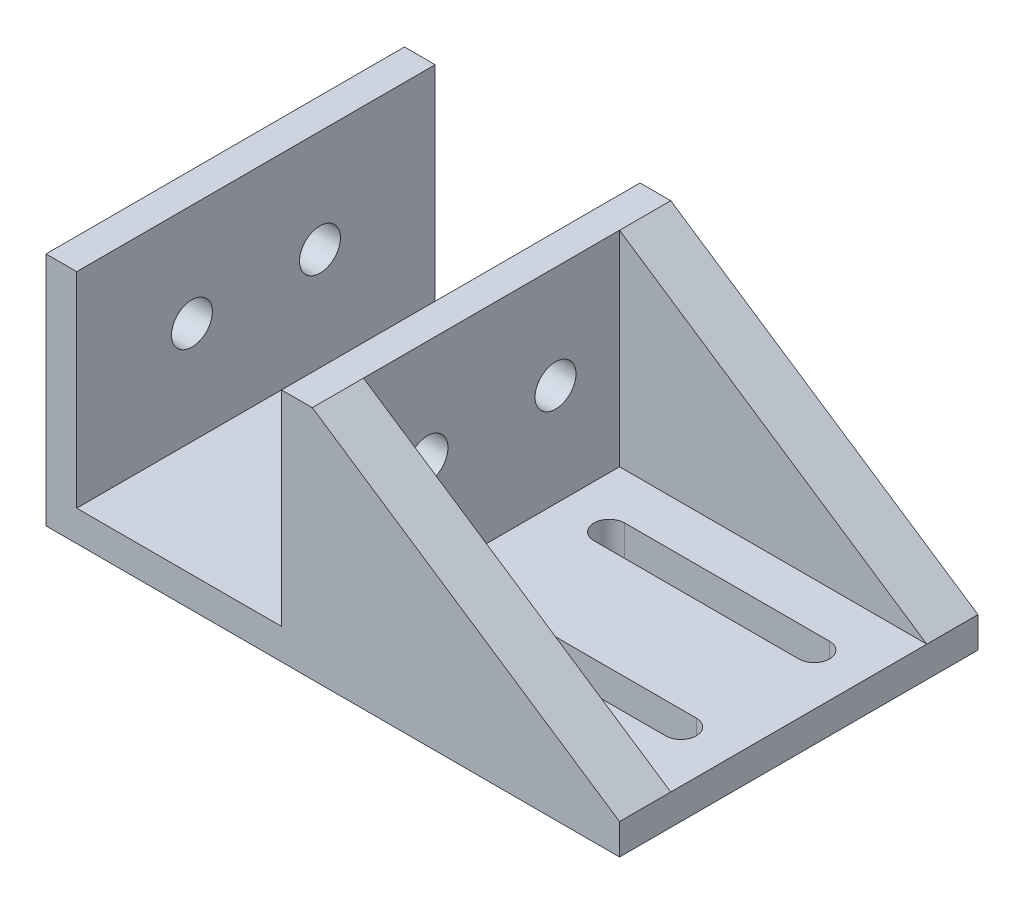
ISO-10303-21;
HEADER;
FILE_DESCRIPTION(('STEP AP214'),'2;1');
FILE_NAME('part.step','',(''),(''),'','','');
FILE_SCHEMA(('AUTOMOTIVE_DESIGN { 1 0 10303 214 1 1 1 1 }'));
ENDSEC;
DATA;
#1=APPLICATION_CONTEXT('core data for automotive mechanical design processes');
#2=APPLICATION_PROTOCOL_DEFINITION('international standard','automotive_design',2000,#1);
#3=PRODUCT_CONTEXT('',#1,'mechanical');
#4=PRODUCT('Part','Part','',(#3));
#5=PRODUCT_RELATED_PRODUCT_CATEGORY('part','',(#4));
#6=PRODUCT_DEFINITION_FORMATION('','',#4);
#7=PRODUCT_DEFINITION_CONTEXT('part definition',#1,'design');
#8=PRODUCT_DEFINITION('design','',#6,#7);
#9=PRODUCT_DEFINITION_SHAPE('','',#8);
#10=(LENGTH_UNIT() NAMED_UNIT(*) SI_UNIT(.MILLI.,.METRE.));
#11=(NAMED_UNIT(*) PLANE_ANGLE_UNIT() SI_UNIT($,.RADIAN.));
#12=(NAMED_UNIT(*) SI_UNIT($,.STERADIAN.) SOLID_ANGLE_UNIT());
#13=UNCERTAINTY_MEASURE_WITH_UNIT(LENGTH_MEASURE(1.E-05),#10,'distance_accuracy_value','');
#14=(GEOMETRIC_REPRESENTATION_CONTEXT(3) GLOBAL_UNCERTAINTY_ASSIGNED_CONTEXT((#13)) GLOBAL_UNIT_ASSIGNED_CONTEXT((#10,
#11,#12)) REPRESENTATION_CONTEXT('',''));
#15=CARTESIAN_POINT('',(0.,0.,0.));
#16=DIRECTION('',(0.,0.,1.));
#17=DIRECTION('',(1.,0.,0.));
#18=AXIS2_PLACEMENT_3D('',#15,#16,#17);
#19=CARTESIAN_POINT('',(56.,3.,0.));
#20=DIRECTION('',(0.554700196225229,0.832050294337844,0.));
#21=DIRECTION('',(-0.832050294337844,0.554700196225229,0.));
#22=AXIS2_PLACEMENT_3D('',#19,#20,#21);
#23=PLANE('',#22);
#24=DIRECTION('',(-0.832050294337844,0.554700196225229,0.));
#25=VECTOR('',#24,1.);
#26=CARTESIAN_POINT('',(56.,3.,5.));
#27=LINE('',#26,#25);
#28=CARTESIAN_POINT('',(56.,3.,5.));
#29=VERTEX_POINT('',#28);
#30=CARTESIAN_POINT('',(26.,23.,5.));
#31=VERTEX_POINT('',#30);
#32=EDGE_CURVE('E11',#29,#31,#27,.T.);
#33=ORIENTED_EDGE('',*,*,#32,.F.);
#34=DIRECTION('',(0.,0.,-1.));
#35=VECTOR('',#34,1.);
#36=CARTESIAN_POINT('',(56.,3.,35.));
#37=LINE('',#36,#35);
#38=CARTESIAN_POINT('',(56.,3.,0.));
#39=VERTEX_POINT('',#38);
#40=EDGE_CURVE('E335',#29,#39,#37,.T.);
#41=ORIENTED_EDGE('',*,*,#40,.T.);
#42=DIRECTION('',(-0.832050294337844,0.554700196225229,0.));
#43=VECTOR('',#42,1.);
#44=CARTESIAN_POINT('',(56.,3.,0.));
#45=LINE('',#44,#43);
#46=CARTESIAN_POINT('',(26.,23.,0.));
#47=VERTEX_POINT('',#46);
#48=EDGE_CURVE('E203',#39,#47,#45,.T.);
#49=ORIENTED_EDGE('',*,*,#48,.T.);
#50=DIRECTION('',(0.,0.,-1.));
#51=VECTOR('',#50,1.);
#52=CARTESIAN_POINT('',(26.,23.,35.));
#53=LINE('',#52,#51);
#54=EDGE_CURVE('E331',#31,#47,#53,.T.);
#55=ORIENTED_EDGE('',*,*,#54,.F.);
#56=EDGE_LOOP('',(#33,#41,#49,#55));
#57=FACE_BOUND('',#56,.T.);
#58=ADVANCED_FACE('F37',(#57),#23,.T.);
#59=CARTESIAN_POINT('',(56.,0.,35.));
#60=DIRECTION('',(-1.,0.,0.));
#61=DIRECTION('',(0.,0.,1.));
#62=AXIS2_PLACEMENT_3D('',#59,#60,#61);
#63=PLANE('',#62);
#64=DIRECTION('',(0.,1.,0.));
#65=VECTOR('',#64,1.);
#66=CARTESIAN_POINT('',(56.,0.,0.));
#67=LINE('',#66,#65);
#68=CARTESIAN_POINT('',(56.,0.,0.));
#69=VERTEX_POINT('',#68);
#70=EDGE_CURVE('E236',#69,#39,#67,.T.);
#71=ORIENTED_EDGE('',*,*,#70,.T.);
#72=ORIENTED_EDGE('',*,*,#40,.F.);
#73=DIRECTION('',(0.,0.,-1.));
#74=VECTOR('',#73,1.);
#75=CARTESIAN_POINT('',(56.,3.,5.));
#76=LINE('',#75,#74);
#77=CARTESIAN_POINT('',(56.,3.,30.));
#78=VERTEX_POINT('',#77);
#79=EDGE_CURVE('E192',#78,#29,#76,.T.);
#80=ORIENTED_EDGE('',*,*,#79,.F.);
#81=CARTESIAN_POINT('',(56.,3.,35.));
#82=VERTEX_POINT('',#81);
#83=EDGE_CURVE('E336',#82,#78,#37,.T.);
#84=ORIENTED_EDGE('',*,*,#83,.F.);
#85=DIRECTION('',(0.,1.,0.));
#86=VECTOR('',#85,1.);
#87=CARTESIAN_POINT('',(56.,0.,35.));
#88=LINE('',#87,#86);
#89=CARTESIAN_POINT('',(56.,0.,35.));
#90=VERTEX_POINT('',#89);
#91=EDGE_CURVE('E278',#90,#82,#88,.T.);
#92=ORIENTED_EDGE('',*,*,#91,.F.);
#93=DIRECTION('',(0.,0.,-1.));
#94=VECTOR('',#93,1.);
#95=CARTESIAN_POINT('',(56.,0.,35.));
#96=LINE('',#95,#94);
#97=EDGE_CURVE('E295',#90,#69,#96,.T.);
#98=ORIENTED_EDGE('',*,*,#97,.T.);
#99=EDGE_LOOP('',(#71,#72,#80,#84,#92,#98));
#100=FACE_BOUND('',#99,.T.);
#101=ADVANCED_FACE('F39',(#100),#63,.F.);
#102=CARTESIAN_POINT('',(26.,23.,35.));
#103=DIRECTION('',(0.,-1.,0.));
#104=DIRECTION('',(0.,0.,-1.));
#105=AXIS2_PLACEMENT_3D('',#102,#103,#104);
#106=PLANE('',#105);
#107=DIRECTION('',(-1.,0.,0.));
#108=VECTOR('',#107,1.);
#109=CARTESIAN_POINT('',(26.,23.,0.));
#110=LINE('',#109,#108);
#111=CARTESIAN_POINT('',(23.,23.,0.));
#112=VERTEX_POINT('',#111);
#113=EDGE_CURVE('E298',#47,#112,#110,.T.);
#114=ORIENTED_EDGE('',*,*,#113,.T.);
#115=DIRECTION('',(0.,0.,-1.));
#116=VECTOR('',#115,1.);
#117=CARTESIAN_POINT('',(23.,23.,35.));
#118=LINE('',#117,#116);
#119=CARTESIAN_POINT('',(23.,23.,35.));
#120=VERTEX_POINT('',#119);
#121=EDGE_CURVE('E328',#120,#112,#118,.T.);
#122=ORIENTED_EDGE('',*,*,#121,.F.);
#123=DIRECTION('',(-1.,0.,0.));
#124=VECTOR('',#123,1.);
#125=CARTESIAN_POINT('',(26.,23.,35.));
#126=LINE('',#125,#124);
#127=CARTESIAN_POINT('',(26.,23.,35.));
#128=VERTEX_POINT('',#127);
#129=EDGE_CURVE('E280',#128,#120,#126,.T.);
#130=ORIENTED_EDGE('',*,*,#129,.F.);
#131=CARTESIAN_POINT('',(26.,23.,30.));
#132=VERTEX_POINT('',#131);
#133=EDGE_CURVE('E332',#128,#132,#53,.T.);
#134=ORIENTED_EDGE('',*,*,#133,.T.);
#135=DIRECTION('',(0.,0.,1.));
#136=VECTOR('',#135,1.);
#137=CARTESIAN_POINT('',(26.,23.,5.));
#138=LINE('',#137,#136);
#139=EDGE_CURVE('E193',#31,#132,#138,.T.);
#140=ORIENTED_EDGE('',*,*,#139,.F.);
#141=ORIENTED_EDGE('',*,*,#54,.T.);
#142=EDGE_LOOP('',(#114,#122,#130,#134,#140,#141));
#143=FACE_BOUND('',#142,.T.);
#144=ADVANCED_FACE('F366',(#143),#106,.F.);
#145=CARTESIAN_POINT('',(23.,23.,35.));
#146=DIRECTION('',(1.,0.,0.));
#147=DIRECTION('',(0.,1.,0.));
#148=AXIS2_PLACEMENT_3D('',#145,#146,#147);
#149=PLANE('',#148);
#150=CARTESIAN_POINT('',(23.,13.,23.75));
#151=DIRECTION('',(1.,0.,0.));
#152=DIRECTION('',(0.,1.,0.));
#153=AXIS2_PLACEMENT_3D('',#150,#151,#152);
#154=CIRCLE('',#153,2.);
#155=CARTESIAN_POINT('',(23.,15.,23.75));
#156=VERTEX_POINT('',#155);
#157=EDGE_CURVE('E195',#156,#156,#154,.T.);
#158=ORIENTED_EDGE('',*,*,#157,.T.);
#159=EDGE_LOOP('',(#158));
#160=FACE_BOUND('',#159,.T.);
#161=CARTESIAN_POINT('',(23.,13.,11.25));
#162=DIRECTION('',(1.,0.,0.));
#163=DIRECTION('',(0.,1.,0.));
#164=AXIS2_PLACEMENT_3D('',#161,#162,#163);
#165=CIRCLE('',#164,2.);
#166=CARTESIAN_POINT('',(23.,15.,11.25));
#167=VERTEX_POINT('',#166);
#168=EDGE_CURVE('E708',#167,#167,#165,.T.);
#169=ORIENTED_EDGE('',*,*,#168,.T.);
#170=EDGE_LOOP('',(#169));
#171=FACE_BOUND('',#170,.T.);
#172=DIRECTION('',(0.,-1.,0.));
#173=VECTOR('',#172,1.);
#174=CARTESIAN_POINT('',(23.,23.,0.));
#175=LINE('',#174,#173);
#176=CARTESIAN_POINT('',(23.,3.,0.));
#177=VERTEX_POINT('',#176);
#178=EDGE_CURVE('E300',#112,#177,#175,.T.);
#179=ORIENTED_EDGE('',*,*,#178,.T.);
#180=DIRECTION('',(0.,0.,-1.));
#181=VECTOR('',#180,1.);
#182=CARTESIAN_POINT('',(23.,3.,35.));
#183=LINE('',#182,#181);
#184=CARTESIAN_POINT('',(23.,3.,35.));
#185=VERTEX_POINT('',#184);
#186=EDGE_CURVE('E325',#185,#177,#183,.T.);
#187=ORIENTED_EDGE('',*,*,#186,.F.);
#188=DIRECTION('',(0.,-1.,0.));
#189=VECTOR('',#188,1.);
#190=CARTESIAN_POINT('',(23.,23.,35.));
#191=LINE('',#190,#189);
#192=EDGE_CURVE('E283',#120,#185,#191,.T.);
#193=ORIENTED_EDGE('',*,*,#192,.F.);
#194=ORIENTED_EDGE('',*,*,#121,.T.);
#195=EDGE_LOOP('',(#179,#187,#193,#194));
#196=FACE_BOUND('',#195,.T.);
#197=ADVANCED_FACE('F370',(#160,#171,#196),#149,.F.);
#198=CARTESIAN_POINT('',(23.,3.,35.));
#199=DIRECTION('',(0.,-1.,0.));
#200=DIRECTION('',(1.,0.,0.));
#201=AXIS2_PLACEMENT_3D('',#198,#199,#200);
#202=PLANE('',#201);
#203=DIRECTION('',(-1.,0.,0.));
#204=VECTOR('',#203,1.);
#205=CARTESIAN_POINT('',(23.,3.,0.));
#206=LINE('',#205,#204);
#207=CARTESIAN_POINT('',(2.99999999999999,3.,0.));
#208=VERTEX_POINT('',#207);
#209=EDGE_CURVE('E302',#177,#208,#206,.T.);
#210=ORIENTED_EDGE('',*,*,#209,.T.);
#211=DIRECTION('',(0.,0.,-1.));
#212=VECTOR('',#211,1.);
#213=CARTESIAN_POINT('',(2.99999999999999,3.,35.));
#214=LINE('',#213,#212);
#215=CARTESIAN_POINT('',(2.99999999999999,3.,35.));
#216=VERTEX_POINT('',#215);
#217=EDGE_CURVE('E322',#216,#208,#214,.T.);
#218=ORIENTED_EDGE('',*,*,#217,.F.);
#219=DIRECTION('',(-1.,0.,0.));
#220=VECTOR('',#219,1.);
#221=CARTESIAN_POINT('',(23.,3.,35.));
#222=LINE('',#221,#220);
#223=EDGE_CURVE('E285',#185,#216,#222,.T.);
#224=ORIENTED_EDGE('',*,*,#223,.F.);
#225=ORIENTED_EDGE('',*,*,#186,.T.);
#226=EDGE_LOOP('',(#210,#218,#224,#225));
#227=FACE_BOUND('',#226,.T.);
#228=ADVANCED_FACE('F376',(#227),#202,.F.);
#229=CARTESIAN_POINT('',(2.99999999999999,3.,35.));
#230=DIRECTION('',(-1.,0.,0.));
#231=DIRECTION('',(0.,-1.,0.));
#232=AXIS2_PLACEMENT_3D('',#229,#230,#231);
#233=PLANE('',#232);
#234=CARTESIAN_POINT('',(2.99999999999999,13.,23.75));
#235=DIRECTION('',(-1.,0.,0.));
#236=DIRECTION('',(0.,-1.,0.));
#237=AXIS2_PLACEMENT_3D('',#234,#235,#236);
#238=CIRCLE('',#237,2.);
#239=CARTESIAN_POINT('',(2.99999999999999,11.,23.75));
#240=VERTEX_POINT('',#239);
#241=EDGE_CURVE('E707',#240,#240,#238,.T.);
#242=ORIENTED_EDGE('',*,*,#241,.T.);
#243=EDGE_LOOP('',(#242));
#244=FACE_BOUND('',#243,.T.);
#245=CARTESIAN_POINT('',(2.99999999999999,13.,11.25));
#246=DIRECTION('',(-1.,0.,0.));
#247=DIRECTION('',(0.,-1.,0.));
#248=AXIS2_PLACEMENT_3D('',#245,#246,#247);
#249=CIRCLE('',#248,2.);
#250=CARTESIAN_POINT('',(2.99999999999999,11.,11.25));
#251=VERTEX_POINT('',#250);
#252=EDGE_CURVE('E712',#251,#251,#249,.T.);
#253=ORIENTED_EDGE('',*,*,#252,.T.);
#254=EDGE_LOOP('',(#253));
#255=FACE_BOUND('',#254,.T.);
#256=DIRECTION('',(0.,1.,0.));
#257=VECTOR('',#256,1.);
#258=CARTESIAN_POINT('',(2.99999999999999,3.,0.));
#259=LINE('',#258,#257);
#260=CARTESIAN_POINT('',(2.99999999999999,23.,0.));
#261=VERTEX_POINT('',#260);
#262=EDGE_CURVE('E304',#208,#261,#259,.T.);
#263=ORIENTED_EDGE('',*,*,#262,.T.);
#264=DIRECTION('',(0.,0.,-1.));
#265=VECTOR('',#264,1.);
#266=CARTESIAN_POINT('',(2.99999999999999,23.,35.));
#267=LINE('',#266,#265);
#268=CARTESIAN_POINT('',(2.99999999999999,23.,35.));
#269=VERTEX_POINT('',#268);
#270=EDGE_CURVE('E319',#269,#261,#267,.T.);
#271=ORIENTED_EDGE('',*,*,#270,.F.);
#272=DIRECTION('',(0.,1.,0.));
#273=VECTOR('',#272,1.);
#274=CARTESIAN_POINT('',(2.99999999999999,3.,35.));
#275=LINE('',#274,#273);
#276=EDGE_CURVE('E287',#216,#269,#275,.T.);
#277=ORIENTED_EDGE('',*,*,#276,.F.);
#278=ORIENTED_EDGE('',*,*,#217,.T.);
#279=EDGE_LOOP('',(#263,#271,#277,#278));
#280=FACE_BOUND('',#279,.T.);
#281=ADVANCED_FACE('F380',(#244,#255,#280),#233,.F.);
#282=CARTESIAN_POINT('',(2.99999999999999,23.,35.));
#283=DIRECTION('',(0.,-1.,0.));
#284=DIRECTION('',(1.,0.,0.));
#285=AXIS2_PLACEMENT_3D('',#282,#283,#284);
#286=PLANE('',#285);
#287=DIRECTION('',(-1.,0.,0.));
#288=VECTOR('',#287,1.);
#289=CARTESIAN_POINT('',(2.99999999999999,23.,0.));
#290=LINE('',#289,#288);
#291=CARTESIAN_POINT('',(0.,23.,0.));
#292=VERTEX_POINT('',#291);
#293=EDGE_CURVE('E306',#261,#292,#290,.T.);
#294=ORIENTED_EDGE('',*,*,#293,.T.);
#295=DIRECTION('',(0.,0.,-1.));
#296=VECTOR('',#295,1.);
#297=CARTESIAN_POINT('',(0.,23.,35.));
#298=LINE('',#297,#296);
#299=CARTESIAN_POINT('',(0.,23.,35.));
#300=VERTEX_POINT('',#299);
#301=EDGE_CURVE('E316',#300,#292,#298,.T.);
#302=ORIENTED_EDGE('',*,*,#301,.F.);
#303=DIRECTION('',(-1.,0.,0.));
#304=VECTOR('',#303,1.);
#305=CARTESIAN_POINT('',(2.99999999999999,23.,35.));
#306=LINE('',#305,#304);
#307=EDGE_CURVE('E289',#269,#300,#306,.T.);
#308=ORIENTED_EDGE('',*,*,#307,.F.);
#309=ORIENTED_EDGE('',*,*,#270,.T.);
#310=EDGE_LOOP('',(#294,#302,#308,#309));
#311=FACE_BOUND('',#310,.T.);
#312=ADVANCED_FACE('F385',(#311),#286,.F.);
#313=CARTESIAN_POINT('',(0.,23.,35.));
#314=DIRECTION('',(1.,0.,0.));
#315=DIRECTION('',(0.,1.,0.));
#316=AXIS2_PLACEMENT_3D('',#313,#314,#315);
#317=PLANE('',#316);
#318=CARTESIAN_POINT('',(0.,13.,23.75));
#319=DIRECTION('',(1.,0.,0.));
#320=DIRECTION('',(0.,0.,-1.));
#321=AXIS2_PLACEMENT_3D('',#318,#319,#320);
#322=CIRCLE('',#321,2.);
#323=CARTESIAN_POINT('',(0.,13.,21.75));
#324=VERTEX_POINT('',#323);
#325=EDGE_CURVE('E704',#324,#324,#322,.T.);
#326=ORIENTED_EDGE('',*,*,#325,.T.);
#327=EDGE_LOOP('',(#326));
#328=FACE_BOUND('',#327,.T.);
#329=CARTESIAN_POINT('',(0.,13.,11.25));
#330=DIRECTION('',(1.,0.,0.));
#331=DIRECTION('',(0.,0.,1.));
#332=AXIS2_PLACEMENT_3D('',#329,#330,#331);
#333=CIRCLE('',#332,2.);
#334=CARTESIAN_POINT('',(0.,13.,13.25));
#335=VERTEX_POINT('',#334);
#336=EDGE_CURVE('E717',#335,#335,#333,.T.);
#337=ORIENTED_EDGE('',*,*,#336,.T.);
#338=EDGE_LOOP('',(#337));
#339=FACE_BOUND('',#338,.T.);
#340=DIRECTION('',(0.,-1.,0.));
#341=VECTOR('',#340,1.);
#342=CARTESIAN_POINT('',(0.,23.,0.));
#343=LINE('',#342,#341);
#344=CARTESIAN_POINT('',(0.,0.,0.));
#345=VERTEX_POINT('',#344);
#346=EDGE_CURVE('E308',#292,#345,#343,.T.);
#347=ORIENTED_EDGE('',*,*,#346,.T.);
#348=DIRECTION('',(0.,0.,-1.));
#349=VECTOR('',#348,1.);
#350=CARTESIAN_POINT('',(0.,0.,35.));
#351=LINE('',#350,#349);
#352=CARTESIAN_POINT('',(0.,0.,35.));
#353=VERTEX_POINT('',#352);
#354=EDGE_CURVE('E313',#353,#345,#351,.T.);
#355=ORIENTED_EDGE('',*,*,#354,.F.);
#356=DIRECTION('',(0.,-1.,0.));
#357=VECTOR('',#356,1.);
#358=CARTESIAN_POINT('',(0.,23.,35.));
#359=LINE('',#358,#357);
#360=EDGE_CURVE('E291',#300,#353,#359,.T.);
#361=ORIENTED_EDGE('',*,*,#360,.F.);
#362=ORIENTED_EDGE('',*,*,#301,.T.);
#363=EDGE_LOOP('',(#347,#355,#361,#362));
#364=FACE_BOUND('',#363,.T.);
#365=ADVANCED_FACE('F389',(#328,#339,#364),#317,.F.);
#366=CARTESIAN_POINT('',(0.,0.,35.));
#367=DIRECTION('',(0.,1.,0.));
#368=DIRECTION('',(0.,0.,1.));
#369=AXIS2_PLACEMENT_3D('',#366,#367,#368);
#370=PLANE('',#369);
#371=DIRECTION('',(-1.,0.,0.));
#372=VECTOR('',#371,1.);
#373=CARTESIAN_POINT('',(31.,0.,9.50000000000001));
#374=LINE('',#373,#372);
#375=CARTESIAN_POINT('',(51.,0.,9.50000000000001));
#376=VERTEX_POINT('',#375);
#377=CARTESIAN_POINT('',(31.,0.,9.50000000000001));
#378=VERTEX_POINT('',#377);
#379=EDGE_CURVE('E217',#376,#378,#374,.T.);
#380=ORIENTED_EDGE('',*,*,#379,.T.);
#381=CARTESIAN_POINT('',(31.,0.,11.));
#382=DIRECTION('',(0.,1.,0.));
#383=DIRECTION('',(-1.,0.,0.));
#384=AXIS2_PLACEMENT_3D('',#381,#382,#383);
#385=CIRCLE('',#384,1.5);
#386=CARTESIAN_POINT('',(31.,0.,12.5));
#387=VERTEX_POINT('',#386);
#388=EDGE_CURVE('E209',#378,#387,#385,.T.);
#389=ORIENTED_EDGE('',*,*,#388,.T.);
#390=DIRECTION('',(1.,0.,0.));
#391=VECTOR('',#390,1.);
#392=CARTESIAN_POINT('',(31.,0.,12.5));
#393=LINE('',#392,#391);
#394=CARTESIAN_POINT('',(51.,0.,12.5));
#395=VERTEX_POINT('',#394);
#396=EDGE_CURVE('E212',#387,#395,#393,.T.);
#397=ORIENTED_EDGE('',*,*,#396,.T.);
#398=CARTESIAN_POINT('',(51.,0.,11.));
#399=DIRECTION('',(0.,1.,0.));
#400=DIRECTION('',(-1.,0.,0.));
#401=AXIS2_PLACEMENT_3D('',#398,#399,#400);
#402=CIRCLE('',#401,1.5);
#403=EDGE_CURVE('E60',#395,#376,#402,.T.);
#404=ORIENTED_EDGE('',*,*,#403,.T.);
#405=EDGE_LOOP('',(#380,#389,#397,#404));
#406=FACE_BOUND('',#405,.T.);
#407=DIRECTION('',(-1.,0.,0.));
#408=VECTOR('',#407,1.);
#409=CARTESIAN_POINT('',(31.,0.,22.5));
#410=LINE('',#409,#408);
#411=CARTESIAN_POINT('',(51.,0.,22.5));
#412=VERTEX_POINT('',#411);
#413=CARTESIAN_POINT('',(31.,0.,22.5));
#414=VERTEX_POINT('',#413);
#415=EDGE_CURVE('E247',#412,#414,#410,.T.);
#416=ORIENTED_EDGE('',*,*,#415,.T.);
#417=CARTESIAN_POINT('',(31.,0.,24.));
#418=DIRECTION('',(0.,1.,0.));
#419=DIRECTION('',(1.,0.,0.));
#420=AXIS2_PLACEMENT_3D('',#417,#418,#419);
#421=CIRCLE('',#420,1.5);
#422=CARTESIAN_POINT('',(31.,0.,25.5));
#423=VERTEX_POINT('',#422);
#424=EDGE_CURVE('E260',#414,#423,#421,.T.);
#425=ORIENTED_EDGE('',*,*,#424,.T.);
#426=DIRECTION('',(1.,0.,0.));
#427=VECTOR('',#426,1.);
#428=CARTESIAN_POINT('',(31.,0.,25.5));
#429=LINE('',#428,#427);
#430=CARTESIAN_POINT('',(51.,0.,25.5));
#431=VERTEX_POINT('',#430);
#432=EDGE_CURVE('E273',#423,#431,#429,.T.);
#433=ORIENTED_EDGE('',*,*,#432,.T.);
#434=CARTESIAN_POINT('',(51.,0.,24.));
#435=DIRECTION('',(0.,1.,0.));
#436=DIRECTION('',(1.,0.,0.));
#437=AXIS2_PLACEMENT_3D('',#434,#435,#436);
#438=CIRCLE('',#437,1.5);
#439=EDGE_CURVE('E270',#431,#412,#438,.T.);
#440=ORIENTED_EDGE('',*,*,#439,.T.);
#441=EDGE_LOOP('',(#416,#425,#433,#440));
#442=FACE_BOUND('',#441,.T.);
#443=DIRECTION('',(1.,0.,0.));
#444=VECTOR('',#443,1.);
#445=CARTESIAN_POINT('',(0.,0.,0.));
#446=LINE('',#445,#444);
#447=EDGE_CURVE('E281',#345,#69,#446,.T.);
#448=ORIENTED_EDGE('',*,*,#447,.T.);
#449=ORIENTED_EDGE('',*,*,#97,.F.);
#450=DIRECTION('',(1.,0.,0.));
#451=VECTOR('',#450,1.);
#452=CARTESIAN_POINT('',(0.,0.,35.));
#453=LINE('',#452,#451);
#454=EDGE_CURVE('E293',#353,#90,#453,.T.);
#455=ORIENTED_EDGE('',*,*,#454,.F.);
#456=ORIENTED_EDGE('',*,*,#354,.T.);
#457=EDGE_LOOP('',(#448,#449,#455,#456));
#458=FACE_BOUND('',#457,.T.);
#459=ADVANCED_FACE('F390',(#406,#442,#458),#370,.F.);
#460=CARTESIAN_POINT('',(0.,0.,35.));
#461=DIRECTION('',(0.,0.,1.));
#462=DIRECTION('',(1.,0.,0.));
#463=AXIS2_PLACEMENT_3D('',#460,#461,#462);
#464=PLANE('',#463);
#465=ORIENTED_EDGE('',*,*,#91,.T.);
#466=DIRECTION('',(-0.832050294337844,0.554700196225229,0.));
#467=VECTOR('',#466,1.);
#468=CARTESIAN_POINT('',(56.,3.,35.));
#469=LINE('',#468,#467);
#470=EDGE_CURVE('E200',#82,#128,#469,.T.);
#471=ORIENTED_EDGE('',*,*,#470,.T.);
#472=ORIENTED_EDGE('',*,*,#129,.T.);
#473=ORIENTED_EDGE('',*,*,#192,.T.);
#474=ORIENTED_EDGE('',*,*,#223,.T.);
#475=ORIENTED_EDGE('',*,*,#276,.T.);
#476=ORIENTED_EDGE('',*,*,#307,.T.);
#477=ORIENTED_EDGE('',*,*,#360,.T.);
#478=ORIENTED_EDGE('',*,*,#454,.T.);
#479=EDGE_LOOP('',(#465,#471,#472,#473,#474,#475,#476,#477,#478));
#480=FACE_BOUND('',#479,.T.);
#481=ADVANCED_FACE('F350',(#480),#464,.T.);
#482=CARTESIAN_POINT('',(0.,0.,0.));
#483=DIRECTION('',(0.,0.,1.));
#484=DIRECTION('',(1.,0.,0.));
#485=AXIS2_PLACEMENT_3D('',#482,#483,#484);
#486=PLANE('',#485);
#487=ORIENTED_EDGE('',*,*,#70,.F.);
#488=ORIENTED_EDGE('',*,*,#447,.F.);
#489=ORIENTED_EDGE('',*,*,#346,.F.);
#490=ORIENTED_EDGE('',*,*,#293,.F.);
#491=ORIENTED_EDGE('',*,*,#262,.F.);
#492=ORIENTED_EDGE('',*,*,#209,.F.);
#493=ORIENTED_EDGE('',*,*,#178,.F.);
#494=ORIENTED_EDGE('',*,*,#113,.F.);
#495=ORIENTED_EDGE('',*,*,#48,.F.);
#496=EDGE_LOOP('',(#487,#488,#489,#490,#491,#492,#493,#494,#495));
#497=FACE_BOUND('',#496,.T.);
#498=ADVANCED_FACE('F359',(#497),#486,.F.);
#499=CARTESIAN_POINT('',(31.,0.,24.));
#500=DIRECTION('',(0.,1.,0.));
#501=DIRECTION('',(-1.,0.,0.));
#502=AXIS2_PLACEMENT_3D('',#499,#500,#501);
#503=CYLINDRICAL_SURFACE('',#502,1.5);
#504=CARTESIAN_POINT('',(31.,3.,24.));
#505=DIRECTION('',(0.,1.,0.));
#506=DIRECTION('',(1.,0.,0.));
#507=AXIS2_PLACEMENT_3D('',#504,#505,#506);
#508=CIRCLE('',#507,1.5);
#509=CARTESIAN_POINT('',(31.,3.,22.5));
#510=VERTEX_POINT('',#509);
#511=CARTESIAN_POINT('',(31.,3.,25.5));
#512=VERTEX_POINT('',#511);
#513=EDGE_CURVE('E225',#510,#512,#508,.T.);
#514=ORIENTED_EDGE('',*,*,#513,.T.);
#515=DIRECTION('',(0.,1.,0.));
#516=VECTOR('',#515,1.);
#517=CARTESIAN_POINT('',(31.,0.,25.5));
#518=LINE('',#517,#516);
#519=EDGE_CURVE('E244',#423,#512,#518,.T.);
#520=ORIENTED_EDGE('',*,*,#519,.F.);
#521=ORIENTED_EDGE('',*,*,#424,.F.);
#522=DIRECTION('',(0.,1.,0.));
#523=VECTOR('',#522,1.);
#524=CARTESIAN_POINT('',(31.,0.,22.5));
#525=LINE('',#524,#523);
#526=EDGE_CURVE('E206',#414,#510,#525,.T.);
#527=ORIENTED_EDGE('',*,*,#526,.T.);
#528=EDGE_LOOP('',(#514,#520,#521,#527));
#529=FACE_BOUND('',#528,.T.);
#530=ADVANCED_FACE('F430',(#529),#503,.F.);
#531=CARTESIAN_POINT('',(31.,0.,22.5));
#532=DIRECTION('',(0.,0.,-1.));
#533=DIRECTION('',(-1.,0.,0.));
#534=AXIS2_PLACEMENT_3D('',#531,#532,#533);
#535=PLANE('',#534);
#536=DIRECTION('',(-1.,0.,0.));
#537=VECTOR('',#536,1.);
#538=CARTESIAN_POINT('',(31.,3.,22.5));
#539=LINE('',#538,#537);
#540=CARTESIAN_POINT('',(51.,3.,22.5));
#541=VERTEX_POINT('',#540);
#542=EDGE_CURVE('E256',#541,#510,#539,.T.);
#543=ORIENTED_EDGE('',*,*,#542,.T.);
#544=ORIENTED_EDGE('',*,*,#526,.F.);
#545=ORIENTED_EDGE('',*,*,#415,.F.);
#546=DIRECTION('',(0.,1.,0.));
#547=VECTOR('',#546,1.);
#548=CARTESIAN_POINT('',(51.,0.,22.5));
#549=LINE('',#548,#547);
#550=EDGE_CURVE('E251',#412,#541,#549,.T.);
#551=ORIENTED_EDGE('',*,*,#550,.T.);
#552=EDGE_LOOP('',(#543,#544,#545,#551));
#553=FACE_BOUND('',#552,.T.);
#554=ADVANCED_FACE('F433',(#553),#535,.F.);
#555=CARTESIAN_POINT('',(51.,0.,24.));
#556=DIRECTION('',(0.,1.,0.));
#557=DIRECTION('',(-1.,0.,0.));
#558=AXIS2_PLACEMENT_3D('',#555,#556,#557);
#559=CYLINDRICAL_SURFACE('',#558,1.5);
#560=CARTESIAN_POINT('',(51.,3.,24.));
#561=DIRECTION('',(0.,1.,0.));
#562=DIRECTION('',(1.,0.,0.));
#563=AXIS2_PLACEMENT_3D('',#560,#561,#562);
#564=CIRCLE('',#563,1.5);
#565=CARTESIAN_POINT('',(51.,3.,25.5));
#566=VERTEX_POINT('',#565);
#567=EDGE_CURVE('E259',#566,#541,#564,.T.);
#568=ORIENTED_EDGE('',*,*,#567,.T.);
#569=ORIENTED_EDGE('',*,*,#550,.F.);
#570=ORIENTED_EDGE('',*,*,#439,.F.);
#571=DIRECTION('',(0.,1.,0.));
#572=VECTOR('',#571,1.);
#573=CARTESIAN_POINT('',(51.,0.,25.5));
#574=LINE('',#573,#572);
#575=EDGE_CURVE('E248',#431,#566,#574,.T.);
#576=ORIENTED_EDGE('',*,*,#575,.T.);
#577=EDGE_LOOP('',(#568,#569,#570,#576));
#578=FACE_BOUND('',#577,.T.);
#579=ADVANCED_FACE('F437',(#578),#559,.F.);
#580=CARTESIAN_POINT('',(31.,0.,25.5));
#581=DIRECTION('',(0.,0.,1.));
#582=DIRECTION('',(1.,0.,0.));
#583=AXIS2_PLACEMENT_3D('',#580,#581,#582);
#584=PLANE('',#583);
#585=DIRECTION('',(1.,0.,0.));
#586=VECTOR('',#585,1.);
#587=CARTESIAN_POINT('',(31.,3.,25.5));
#588=LINE('',#587,#586);
#589=EDGE_CURVE('E263',#512,#566,#588,.T.);
#590=ORIENTED_EDGE('',*,*,#589,.T.);
#591=ORIENTED_EDGE('',*,*,#575,.F.);
#592=ORIENTED_EDGE('',*,*,#432,.F.);
#593=ORIENTED_EDGE('',*,*,#519,.T.);
#594=EDGE_LOOP('',(#590,#591,#592,#593));
#595=FACE_BOUND('',#594,.T.);
#596=ADVANCED_FACE('F428',(#595),#584,.F.);
#597=CARTESIAN_POINT('',(31.,0.,11.));
#598=DIRECTION('',(0.,1.,0.));
#599=DIRECTION('',(-1.,0.,0.));
#600=AXIS2_PLACEMENT_3D('',#597,#598,#599);
#601=CYLINDRICAL_SURFACE('',#600,1.5);
#602=CARTESIAN_POINT('',(31.,3.,11.));
#603=DIRECTION('',(0.,1.,0.));
#604=DIRECTION('',(-1.,0.,0.));
#605=AXIS2_PLACEMENT_3D('',#602,#603,#604);
#606=CIRCLE('',#605,1.5);
#607=CARTESIAN_POINT('',(31.,3.,9.50000000000001));
#608=VERTEX_POINT('',#607);
#609=CARTESIAN_POINT('',(31.,3.,12.5));
#610=VERTEX_POINT('',#609);
#611=EDGE_CURVE('E221',#608,#610,#606,.T.);
#612=ORIENTED_EDGE('',*,*,#611,.T.);
#613=DIRECTION('',(0.,1.,0.));
#614=VECTOR('',#613,1.);
#615=CARTESIAN_POINT('',(31.,0.,12.5));
#616=LINE('',#615,#614);
#617=EDGE_CURVE('E220',#387,#610,#616,.T.);
#618=ORIENTED_EDGE('',*,*,#617,.F.);
#619=ORIENTED_EDGE('',*,*,#388,.F.);
#620=DIRECTION('',(0.,1.,0.));
#621=VECTOR('',#620,1.);
#622=CARTESIAN_POINT('',(31.,0.,9.50000000000001));
#623=LINE('',#622,#621);
#624=EDGE_CURVE('E233',#378,#608,#623,.T.);
#625=ORIENTED_EDGE('',*,*,#624,.T.);
#626=EDGE_LOOP('',(#612,#618,#619,#625));
#627=FACE_BOUND('',#626,.T.);
#628=ADVANCED_FACE('F425',(#627),#601,.F.);
#629=CARTESIAN_POINT('',(31.,0.,9.50000000000001));
#630=DIRECTION('',(0.,0.,-1.));
#631=DIRECTION('',(-1.,0.,0.));
#632=AXIS2_PLACEMENT_3D('',#629,#630,#631);
#633=PLANE('',#632);
#634=DIRECTION('',(-1.,0.,0.));
#635=VECTOR('',#634,1.);
#636=CARTESIAN_POINT('',(31.,3.,9.50000000000001));
#637=LINE('',#636,#635);
#638=CARTESIAN_POINT('',(51.,3.,9.5));
#639=VERTEX_POINT('',#638);
#640=EDGE_CURVE('E213',#639,#608,#637,.T.);
#641=ORIENTED_EDGE('',*,*,#640,.T.);
#642=ORIENTED_EDGE('',*,*,#624,.F.);
#643=ORIENTED_EDGE('',*,*,#379,.F.);
#644=DIRECTION('',(0.,1.,0.));
#645=VECTOR('',#644,1.);
#646=CARTESIAN_POINT('',(51.,0.,9.50000000000001));
#647=LINE('',#646,#645);
#648=EDGE_CURVE('E237',#376,#639,#647,.T.);
#649=ORIENTED_EDGE('',*,*,#648,.T.);
#650=EDGE_LOOP('',(#641,#642,#643,#649));
#651=FACE_BOUND('',#650,.T.);
#652=ADVANCED_FACE('F422',(#651),#633,.F.);
#653=CARTESIAN_POINT('',(51.,0.,11.));
#654=DIRECTION('',(0.,1.,0.));
#655=DIRECTION('',(-1.,0.,0.));
#656=AXIS2_PLACEMENT_3D('',#653,#654,#655);
#657=CYLINDRICAL_SURFACE('',#656,1.5);
#658=CARTESIAN_POINT('',(51.,3.,11.));
#659=DIRECTION('',(0.,1.,0.));
#660=DIRECTION('',(-1.,0.,0.));
#661=AXIS2_PLACEMENT_3D('',#658,#659,#660);
#662=CIRCLE('',#661,1.5);
#663=CARTESIAN_POINT('',(51.,3.,12.5));
#664=VERTEX_POINT('',#663);
#665=EDGE_CURVE('E228',#664,#639,#662,.T.);
#666=ORIENTED_EDGE('',*,*,#665,.T.);
#667=ORIENTED_EDGE('',*,*,#648,.F.);
#668=ORIENTED_EDGE('',*,*,#403,.F.);
#669=DIRECTION('',(0.,1.,0.));
#670=VECTOR('',#669,1.);
#671=CARTESIAN_POINT('',(51.,0.,12.5));
#672=LINE('',#671,#670);
#673=EDGE_CURVE('E240',#395,#664,#672,.T.);
#674=ORIENTED_EDGE('',*,*,#673,.T.);
#675=EDGE_LOOP('',(#666,#667,#668,#674));
#676=FACE_BOUND('',#675,.T.);
#677=ADVANCED_FACE('F416',(#676),#657,.F.);
#678=CARTESIAN_POINT('',(31.,0.,12.5));
#679=DIRECTION('',(0.,0.,1.));
#680=DIRECTION('',(1.,0.,0.));
#681=AXIS2_PLACEMENT_3D('',#678,#679,#680);
#682=PLANE('',#681);
#683=DIRECTION('',(1.,0.,0.));
#684=VECTOR('',#683,1.);
#685=CARTESIAN_POINT('',(31.,3.,12.5));
#686=LINE('',#685,#684);
#687=EDGE_CURVE('E224',#610,#664,#686,.T.);
#688=ORIENTED_EDGE('',*,*,#687,.T.);
#689=ORIENTED_EDGE('',*,*,#673,.F.);
#690=ORIENTED_EDGE('',*,*,#396,.F.);
#691=ORIENTED_EDGE('',*,*,#617,.T.);
#692=EDGE_LOOP('',(#688,#689,#690,#691));
#693=FACE_BOUND('',#692,.T.);
#694=ADVANCED_FACE('F411',(#693),#682,.F.);
#695=DIRECTION('',(0.832050294337844,-0.554700196225229,0.));
#696=VECTOR('',#695,1.);
#697=CARTESIAN_POINT('',(56.,3.,30.));
#698=LINE('',#697,#696);
#699=EDGE_CURVE('E45',#132,#78,#698,.T.);
#700=ORIENTED_EDGE('',*,*,#699,.F.);
#701=ORIENTED_EDGE('',*,*,#133,.F.);
#702=ORIENTED_EDGE('',*,*,#470,.F.);
#703=ORIENTED_EDGE('',*,*,#83,.T.);
#704=EDGE_LOOP('',(#700,#701,#702,#703));
#705=FACE_BOUND('',#704,.T.);
#706=ADVANCED_FACE('F348',(#705),#23,.T.);
#707=CARTESIAN_POINT('',(23.,3.,35.));
#708=DIRECTION('',(0.,-1.,0.));
#709=DIRECTION('',(1.,0.,0.));
#710=AXIS2_PLACEMENT_3D('',#707,#708,#709);
#711=PLANE('',#710);
#712=ORIENTED_EDGE('',*,*,#79,.T.);
#713=DIRECTION('',(-1.,0.,0.));
#714=VECTOR('',#713,1.);
#715=CARTESIAN_POINT('',(26.,3.,5.));
#716=LINE('',#715,#714);
#717=CARTESIAN_POINT('',(26.,3.,5.));
#718=VERTEX_POINT('',#717);
#719=EDGE_CURVE('E186',#29,#718,#716,.T.);
#720=ORIENTED_EDGE('',*,*,#719,.T.);
#721=DIRECTION('',(0.,0.,1.));
#722=VECTOR('',#721,1.);
#723=CARTESIAN_POINT('',(26.,3.,5.));
#724=LINE('',#723,#722);
#725=CARTESIAN_POINT('',(26.,3.,30.));
#726=VERTEX_POINT('',#725);
#727=EDGE_CURVE('E175',#718,#726,#724,.T.);
#728=ORIENTED_EDGE('',*,*,#727,.T.);
#729=DIRECTION('',(1.,0.,0.));
#730=VECTOR('',#729,1.);
#731=CARTESIAN_POINT('',(26.,3.,30.));
#732=LINE('',#731,#730);
#733=EDGE_CURVE('E52',#726,#78,#732,.T.);
#734=ORIENTED_EDGE('',*,*,#733,.T.);
#735=EDGE_LOOP('',(#712,#720,#728,#734));
#736=FACE_BOUND('',#735,.T.);
#737=ORIENTED_EDGE('',*,*,#542,.F.);
#738=ORIENTED_EDGE('',*,*,#567,.F.);
#739=ORIENTED_EDGE('',*,*,#589,.F.);
#740=ORIENTED_EDGE('',*,*,#513,.F.);
#741=EDGE_LOOP('',(#737,#738,#739,#740));
#742=FACE_BOUND('',#741,.T.);
#743=ORIENTED_EDGE('',*,*,#640,.F.);
#744=ORIENTED_EDGE('',*,*,#665,.F.);
#745=ORIENTED_EDGE('',*,*,#687,.F.);
#746=ORIENTED_EDGE('',*,*,#611,.F.);
#747=EDGE_LOOP('',(#743,#744,#745,#746));
#748=FACE_BOUND('',#747,.T.);
#749=ADVANCED_FACE('F189',(#736,#742,#748),#711,.F.);
#750=CARTESIAN_POINT('',(26.,-36.0512483795333,5.));
#751=DIRECTION('',(0.,0.,-1.));
#752=DIRECTION('',(-1.,0.,0.));
#753=AXIS2_PLACEMENT_3D('',#750,#751,#752);
#754=PLANE('',#753);
#755=ORIENTED_EDGE('',*,*,#32,.T.);
#756=DIRECTION('',(0.,1.,0.));
#757=VECTOR('',#756,1.);
#758=CARTESIAN_POINT('',(26.,-36.0512483795333,5.));
#759=LINE('',#758,#757);
#760=EDGE_CURVE('E179',#718,#31,#759,.T.);
#761=ORIENTED_EDGE('',*,*,#760,.F.);
#762=ORIENTED_EDGE('',*,*,#719,.F.);
#763=EDGE_LOOP('',(#755,#761,#762));
#764=FACE_BOUND('',#763,.T.);
#765=ADVANCED_FACE('F185',(#764),#754,.F.);
#766=CARTESIAN_POINT('',(26.,-36.0512483795333,5.));
#767=DIRECTION('',(-1.,0.,0.));
#768=DIRECTION('',(0.,0.,1.));
#769=AXIS2_PLACEMENT_3D('',#766,#767,#768);
#770=PLANE('',#769);
#771=CARTESIAN_POINT('',(26.,13.,23.75));
#772=DIRECTION('',(1.,0.,0.));
#773=DIRECTION('',(0.,0.,-1.));
#774=AXIS2_PLACEMENT_3D('',#771,#772,#773);
#775=CIRCLE('',#774,2.);
#776=CARTESIAN_POINT('',(26.,13.,21.75));
#777=VERTEX_POINT('',#776);
#778=EDGE_CURVE('E723',#777,#777,#775,.T.);
#779=ORIENTED_EDGE('',*,*,#778,.F.);
#780=EDGE_LOOP('',(#779));
#781=FACE_BOUND('',#780,.T.);
#782=CARTESIAN_POINT('',(26.,13.,11.25));
#783=DIRECTION('',(1.,0.,0.));
#784=DIRECTION('',(0.,0.,1.));
#785=AXIS2_PLACEMENT_3D('',#782,#783,#784);
#786=CIRCLE('',#785,2.);
#787=CARTESIAN_POINT('',(26.,13.,13.25));
#788=VERTEX_POINT('',#787);
#789=EDGE_CURVE('E720',#788,#788,#786,.T.);
#790=ORIENTED_EDGE('',*,*,#789,.F.);
#791=EDGE_LOOP('',(#790));
#792=FACE_BOUND('',#791,.T.);
#793=ORIENTED_EDGE('',*,*,#760,.T.);
#794=ORIENTED_EDGE('',*,*,#139,.T.);
#795=DIRECTION('',(0.,1.,0.));
#796=VECTOR('',#795,1.);
#797=CARTESIAN_POINT('',(26.,-36.0512483795333,30.));
#798=LINE('',#797,#796);
#799=EDGE_CURVE('E181',#726,#132,#798,.T.);
#800=ORIENTED_EDGE('',*,*,#799,.F.);
#801=ORIENTED_EDGE('',*,*,#727,.F.);
#802=EDGE_LOOP('',(#793,#794,#800,#801));
#803=FACE_BOUND('',#802,.T.);
#804=ADVANCED_FACE('F177',(#781,#792,#803),#770,.F.);
#805=CARTESIAN_POINT('',(26.,-36.0512483795333,30.));
#806=DIRECTION('',(0.,0.,1.));
#807=DIRECTION('',(1.,0.,0.));
#808=AXIS2_PLACEMENT_3D('',#805,#806,#807);
#809=PLANE('',#808);
#810=ORIENTED_EDGE('',*,*,#699,.T.);
#811=ORIENTED_EDGE('',*,*,#733,.F.);
#812=ORIENTED_EDGE('',*,*,#799,.T.);
#813=EDGE_LOOP('',(#810,#811,#812));
#814=FACE_BOUND('',#813,.T.);
#815=ADVANCED_FACE('F340',(#814),#809,.F.);
#816=CARTESIAN_POINT('',(0.,13.,11.25));
#817=DIRECTION('',(1.,0.,0.));
#818=DIRECTION('',(0.,0.,-1.));
#819=AXIS2_PLACEMENT_3D('',#816,#817,#818);
#820=CYLINDRICAL_SURFACE('',#819,2.);
#821=ORIENTED_EDGE('',*,*,#789,.T.);
#822=EDGE_LOOP('',(#821));
#823=FACE_BOUND('',#822,.T.);
#824=ORIENTED_EDGE('',*,*,#168,.F.);
#825=EDGE_LOOP('',(#824));
#826=FACE_BOUND('',#825,.T.);
#827=ADVANCED_FACE('F520',(#823,#826),#820,.F.);
#828=CARTESIAN_POINT('',(0.,13.,23.75));
#829=DIRECTION('',(1.,0.,0.));
#830=DIRECTION('',(0.,0.,-1.));
#831=AXIS2_PLACEMENT_3D('',#828,#829,#830);
#832=CYLINDRICAL_SURFACE('',#831,2.);
#833=ORIENTED_EDGE('',*,*,#778,.T.);
#834=EDGE_LOOP('',(#833));
#835=FACE_BOUND('',#834,.T.);
#836=ORIENTED_EDGE('',*,*,#157,.F.);
#837=EDGE_LOOP('',(#836));
#838=FACE_BOUND('',#837,.T.);
#839=ADVANCED_FACE('F572',(#835,#838),#832,.F.);
#840=ORIENTED_EDGE('',*,*,#336,.F.);
#841=EDGE_LOOP('',(#840));
#842=FACE_BOUND('',#841,.T.);
#843=ORIENTED_EDGE('',*,*,#252,.F.);
#844=EDGE_LOOP('',(#843));
#845=FACE_BOUND('',#844,.T.);
#846=ADVANCED_FACE('F575',(#842,#845),#820,.F.);
#847=ORIENTED_EDGE('',*,*,#325,.F.);
#848=EDGE_LOOP('',(#847));
#849=FACE_BOUND('',#848,.T.);
#850=ORIENTED_EDGE('',*,*,#241,.F.);
#851=EDGE_LOOP('',(#850));
#852=FACE_BOUND('',#851,.T.);
#853=ADVANCED_FACE('F586',(#849,#852),#832,.F.);
#854=CLOSED_SHELL('',(#58,#101,#144,#197,#228,#281,#312,#365,#459,#481,#498,#530,#554,#579,#596,
#628,#652,#677,#694,#706,#749,#765,#804,#815,#827,#839,#846,#853));
#855=MANIFOLD_SOLID_BREP('B2',#854);
#856=ADVANCED_BREP_SHAPE_REPRESENTATION('',(#18,#855),#14);
#857=SHAPE_DEFINITION_REPRESENTATION(#9,#856);
ENDSEC;
END-ISO-10303-21;
